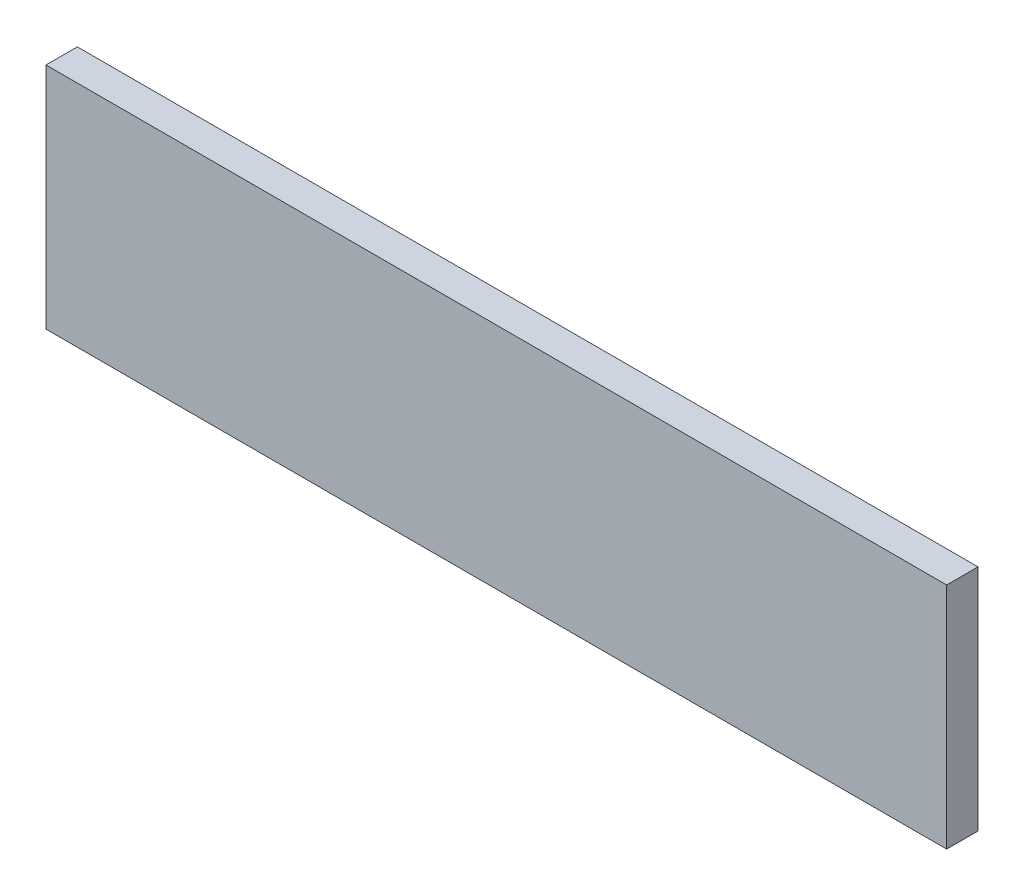
ISO-10303-21;
HEADER;
FILE_DESCRIPTION(('STEP AP214'),'2;1');
FILE_NAME('part.step','',(''),(''),'','','');
FILE_SCHEMA(('AUTOMOTIVE_DESIGN { 1 0 10303 214 1 1 1 1 }'));
ENDSEC;
DATA;
#1=APPLICATION_CONTEXT('core data for automotive mechanical design processes');
#2=APPLICATION_PROTOCOL_DEFINITION('international standard','automotive_design',2000,#1);
#3=PRODUCT_CONTEXT('',#1,'mechanical');
#4=PRODUCT('Part','Part','',(#3));
#5=PRODUCT_RELATED_PRODUCT_CATEGORY('part','',(#4));
#6=PRODUCT_DEFINITION_FORMATION('','',#4);
#7=PRODUCT_DEFINITION_CONTEXT('part definition',#1,'design');
#8=PRODUCT_DEFINITION('design','',#6,#7);
#9=PRODUCT_DEFINITION_SHAPE('','',#8);
#10=(LENGTH_UNIT() NAMED_UNIT(*) SI_UNIT(.MILLI.,.METRE.));
#11=(NAMED_UNIT(*) PLANE_ANGLE_UNIT() SI_UNIT($,.RADIAN.));
#12=(NAMED_UNIT(*) SI_UNIT($,.STERADIAN.) SOLID_ANGLE_UNIT());
#13=UNCERTAINTY_MEASURE_WITH_UNIT(LENGTH_MEASURE(1.E-05),#10,'distance_accuracy_value','');
#14=(GEOMETRIC_REPRESENTATION_CONTEXT(3) GLOBAL_UNCERTAINTY_ASSIGNED_CONTEXT((#13)) GLOBAL_UNIT_ASSIGNED_CONTEXT((#10,
#11,#12)) REPRESENTATION_CONTEXT('',''));
#15=CARTESIAN_POINT('',(0.,0.,0.));
#16=DIRECTION('',(0.,0.,1.));
#17=DIRECTION('',(1.,0.,0.));
#18=AXIS2_PLACEMENT_3D('',#15,#16,#17);
#19=CARTESIAN_POINT('',(19.8000000159999,0.,-9.525));
#20=DIRECTION('',(1.,0.,0.));
#21=DIRECTION('',(0.,0.,-1.));
#22=AXIS2_PLACEMENT_3D('',#19,#20,#21);
#23=PLANE('',#22);
#24=DIRECTION('',(0.,1.,0.));
#25=VECTOR('',#24,1.);
#26=CARTESIAN_POINT('',(19.8000000159999,0.,0.));
#27=LINE('',#26,#25);
#28=CARTESIAN_POINT('',(19.8000000159999,0.,0.));
#29=VERTEX_POINT('',#28);
#30=CARTESIAN_POINT('',(19.8000000159999,69.5000000000098,0.));
#31=VERTEX_POINT('',#30);
#32=EDGE_CURVE('E97',#29,#31,#27,.T.);
#33=ORIENTED_EDGE('',*,*,#32,.F.);
#34=DIRECTION('',(0.,0.,1.));
#35=VECTOR('',#34,1.);
#36=CARTESIAN_POINT('',(19.8000000159999,0.,-9.525));
#37=LINE('',#36,#35);
#38=CARTESIAN_POINT('',(19.8000000159999,0.,-9.525));
#39=VERTEX_POINT('',#38);
#40=EDGE_CURVE('E11',#39,#29,#37,.T.);
#41=ORIENTED_EDGE('',*,*,#40,.F.);
#42=DIRECTION('',(0.,1.,0.));
#43=VECTOR('',#42,1.);
#44=CARTESIAN_POINT('',(19.8000000159999,0.,-9.525));
#45=LINE('',#44,#43);
#46=CARTESIAN_POINT('',(19.8000000159999,69.5000000000098,-9.525));
#47=VERTEX_POINT('',#46);
#48=EDGE_CURVE('E91',#39,#47,#45,.T.);
#49=ORIENTED_EDGE('',*,*,#48,.T.);
#50=DIRECTION('',(0.,0.,1.));
#51=VECTOR('',#50,1.);
#52=CARTESIAN_POINT('',(19.8000000159999,69.5000000000098,-9.525));
#53=LINE('',#52,#51);
#54=EDGE_CURVE('E36',#47,#31,#53,.T.);
#55=ORIENTED_EDGE('',*,*,#54,.T.);
#56=EDGE_LOOP('',(#33,#41,#49,#55));
#57=FACE_BOUND('',#56,.T.);
#58=ADVANCED_FACE('F33',(#57),#23,.T.);
#59=CARTESIAN_POINT('',(19.8000000159999,0.,-9.525));
#60=DIRECTION('',(0.,-1.,0.));
#61=DIRECTION('',(1.,0.,0.));
#62=AXIS2_PLACEMENT_3D('',#59,#60,#61);
#63=PLANE('',#62);
#64=DIRECTION('',(1.,0.,0.));
#65=VECTOR('',#64,1.);
#66=CARTESIAN_POINT('',(19.8000000159999,0.,0.));
#67=LINE('',#66,#65);
#68=CARTESIAN_POINT('',(-253.800000016,0.,0.));
#69=VERTEX_POINT('',#68);
#70=EDGE_CURVE('E93',#69,#29,#67,.T.);
#71=ORIENTED_EDGE('',*,*,#70,.F.);
#72=DIRECTION('',(0.,0.,1.));
#73=VECTOR('',#72,1.);
#74=CARTESIAN_POINT('',(-253.800000016,0.,-9.525));
#75=LINE('',#74,#73);
#76=CARTESIAN_POINT('',(-253.800000016,0.,-9.525));
#77=VERTEX_POINT('',#76);
#78=EDGE_CURVE('E42',#77,#69,#75,.T.);
#79=ORIENTED_EDGE('',*,*,#78,.F.);
#80=DIRECTION('',(1.,0.,0.));
#81=VECTOR('',#80,1.);
#82=CARTESIAN_POINT('',(19.8000000159999,0.,-9.525));
#83=LINE('',#82,#81);
#84=EDGE_CURVE('E88',#77,#39,#83,.T.);
#85=ORIENTED_EDGE('',*,*,#84,.T.);
#86=ORIENTED_EDGE('',*,*,#40,.T.);
#87=EDGE_LOOP('',(#71,#79,#85,#86));
#88=FACE_BOUND('',#87,.T.);
#89=ADVANCED_FACE('F107',(#88),#63,.T.);
#90=CARTESIAN_POINT('',(-253.800000016,0.,-9.525));
#91=DIRECTION('',(-1.,0.,0.));
#92=DIRECTION('',(0.,0.,1.));
#93=AXIS2_PLACEMENT_3D('',#90,#91,#92);
#94=PLANE('',#93);
#95=DIRECTION('',(0.,-1.,0.));
#96=VECTOR('',#95,1.);
#97=CARTESIAN_POINT('',(-253.800000016,0.,0.));
#98=LINE('',#97,#96);
#99=CARTESIAN_POINT('',(-253.800000016,69.5000000000098,0.));
#100=VERTEX_POINT('',#99);
#101=EDGE_CURVE('E83',#100,#69,#98,.T.);
#102=ORIENTED_EDGE('',*,*,#101,.F.);
#103=DIRECTION('',(0.,0.,1.));
#104=VECTOR('',#103,1.);
#105=CARTESIAN_POINT('',(-253.800000016,69.5000000000098,-9.525));
#106=LINE('',#105,#104);
#107=CARTESIAN_POINT('',(-253.800000016,69.5000000000098,-9.525));
#108=VERTEX_POINT('',#107);
#109=EDGE_CURVE('E78',#108,#100,#106,.T.);
#110=ORIENTED_EDGE('',*,*,#109,.F.);
#111=DIRECTION('',(0.,-1.,0.));
#112=VECTOR('',#111,1.);
#113=CARTESIAN_POINT('',(-253.800000016,0.,-9.525));
#114=LINE('',#113,#112);
#115=EDGE_CURVE('E81',#108,#77,#114,.T.);
#116=ORIENTED_EDGE('',*,*,#115,.T.);
#117=ORIENTED_EDGE('',*,*,#78,.T.);
#118=EDGE_LOOP('',(#102,#110,#116,#117));
#119=FACE_BOUND('',#118,.T.);
#120=ADVANCED_FACE('F80',(#119),#94,.T.);
#121=CARTESIAN_POINT('',(19.8000000159999,69.5000000000098,-9.525));
#122=DIRECTION('',(0.,1.,0.));
#123=DIRECTION('',(-1.,0.,0.));
#124=AXIS2_PLACEMENT_3D('',#121,#122,#123);
#125=PLANE('',#124);
#126=DIRECTION('',(-1.,0.,0.));
#127=VECTOR('',#126,1.);
#128=CARTESIAN_POINT('',(19.8000000159999,69.5000000000098,0.));
#129=LINE('',#128,#127);
#130=EDGE_CURVE('E100',#31,#100,#129,.T.);
#131=ORIENTED_EDGE('',*,*,#130,.F.);
#132=ORIENTED_EDGE('',*,*,#54,.F.);
#133=DIRECTION('',(-1.,0.,0.));
#134=VECTOR('',#133,1.);
#135=CARTESIAN_POINT('',(19.8000000159999,69.5000000000098,-9.525));
#136=LINE('',#135,#134);
#137=EDGE_CURVE('E87',#47,#108,#136,.T.);
#138=ORIENTED_EDGE('',*,*,#137,.T.);
#139=ORIENTED_EDGE('',*,*,#109,.T.);
#140=EDGE_LOOP('',(#131,#132,#138,#139));
#141=FACE_BOUND('',#140,.T.);
#142=ADVANCED_FACE('F90',(#141),#125,.T.);
#143=CARTESIAN_POINT('',(0.,0.,-9.525));
#144=DIRECTION('',(0.,0.,1.));
#145=DIRECTION('',(1.,0.,0.));
#146=AXIS2_PLACEMENT_3D('',#143,#144,#145);
#147=PLANE('',#146);
#148=ORIENTED_EDGE('',*,*,#48,.F.);
#149=ORIENTED_EDGE('',*,*,#84,.F.);
#150=ORIENTED_EDGE('',*,*,#115,.F.);
#151=ORIENTED_EDGE('',*,*,#137,.F.);
#152=EDGE_LOOP('',(#148,#149,#150,#151));
#153=FACE_BOUND('',#152,.T.);
#154=ADVANCED_FACE('F86',(#153),#147,.F.);
#155=CARTESIAN_POINT('',(0.,0.,0.));
#156=DIRECTION('',(0.,0.,1.));
#157=DIRECTION('',(1.,0.,0.));
#158=AXIS2_PLACEMENT_3D('',#155,#156,#157);
#159=PLANE('',#158);
#160=ORIENTED_EDGE('',*,*,#32,.T.);
#161=ORIENTED_EDGE('',*,*,#130,.T.);
#162=ORIENTED_EDGE('',*,*,#101,.T.);
#163=ORIENTED_EDGE('',*,*,#70,.T.);
#164=EDGE_LOOP('',(#160,#161,#162,#163));
#165=FACE_BOUND('',#164,.T.);
#166=ADVANCED_FACE('F106',(#165),#159,.T.);
#167=CLOSED_SHELL('',(#58,#89,#120,#142,#154,#166));
#168=MANIFOLD_SOLID_BREP('B2',#167);
#169=ADVANCED_BREP_SHAPE_REPRESENTATION('',(#18,#168),#14);
#170=SHAPE_DEFINITION_REPRESENTATION(#9,#169);
ENDSEC;
END-ISO-10303-21;
